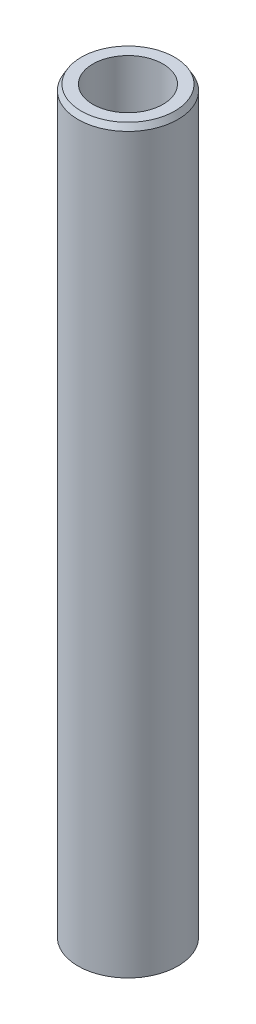
ISO-10303-21;
HEADER;
FILE_DESCRIPTION(('STEP AP214'),'2;1');
FILE_NAME('part.step','',(''),(''),'','','');
FILE_SCHEMA(('AUTOMOTIVE_DESIGN { 1 0 10303 214 1 1 1 1 }'));
ENDSEC;
DATA;
#1=APPLICATION_CONTEXT('core data for automotive mechanical design processes');
#2=APPLICATION_PROTOCOL_DEFINITION('international standard','automotive_design',2000,#1);
#3=PRODUCT_CONTEXT('',#1,'mechanical');
#4=PRODUCT('Part','Part','',(#3));
#5=PRODUCT_RELATED_PRODUCT_CATEGORY('part','',(#4));
#6=PRODUCT_DEFINITION_FORMATION('','',#4);
#7=PRODUCT_DEFINITION_CONTEXT('part definition',#1,'design');
#8=PRODUCT_DEFINITION('design','',#6,#7);
#9=PRODUCT_DEFINITION_SHAPE('','',#8);
#10=(LENGTH_UNIT() NAMED_UNIT(*) SI_UNIT(.MILLI.,.METRE.));
#11=(NAMED_UNIT(*) PLANE_ANGLE_UNIT() SI_UNIT($,.RADIAN.));
#12=(NAMED_UNIT(*) SI_UNIT($,.STERADIAN.) SOLID_ANGLE_UNIT());
#13=UNCERTAINTY_MEASURE_WITH_UNIT(LENGTH_MEASURE(1.E-05),#10,'distance_accuracy_value','');
#14=(GEOMETRIC_REPRESENTATION_CONTEXT(3) GLOBAL_UNCERTAINTY_ASSIGNED_CONTEXT((#13)) GLOBAL_UNIT_ASSIGNED_CONTEXT((#10,
#11,#12)) REPRESENTATION_CONTEXT('',''));
#15=CARTESIAN_POINT('',(0.,0.,0.));
#16=DIRECTION('',(0.,0.,1.));
#17=DIRECTION('',(1.,0.,0.));
#18=AXIS2_PLACEMENT_3D('',#15,#16,#17);
#19=CARTESIAN_POINT('',(0.,222.741329278908,0.));
#20=DIRECTION('',(0.,-1.,0.));
#21=DIRECTION('',(0.,0.,-1.));
#22=AXIS2_PLACEMENT_3D('',#19,#20,#21);
#23=CYLINDRICAL_SURFACE('',#22,15.);
#24=CARTESIAN_POINT('',(0.,221.051541674111,0.));
#25=DIRECTION('',(0.,1.,0.));
#26=DIRECTION('',(0.,0.,1.));
#27=AXIS2_PLACEMENT_3D('',#24,#25,#26);
#28=CIRCLE('',#27,15.);
#29=CARTESIAN_POINT('',(0.,221.051541674111,15.));
#30=VERTEX_POINT('',#29);
#31=EDGE_CURVE('E50',#30,#30,#28,.F.);
#32=ORIENTED_EDGE('',*,*,#31,.T.);
#33=EDGE_LOOP('',(#32));
#34=FACE_BOUND('',#33,.T.);
#35=CARTESIAN_POINT('',(0.,0.975599328502386,0.));
#36=DIRECTION('',(0.,1.,0.));
#37=DIRECTION('',(0.,0.,1.));
#38=AXIS2_PLACEMENT_3D('',#35,#36,#37);
#39=CIRCLE('',#38,15.);
#40=CARTESIAN_POINT('',(0.,0.975599328502386,15.));
#41=VERTEX_POINT('',#40);
#42=EDGE_CURVE('E51',#41,#41,#39,.T.);
#43=ORIENTED_EDGE('',*,*,#42,.T.);
#44=EDGE_LOOP('',(#43));
#45=FACE_BOUND('',#44,.T.);
#46=ADVANCED_FACE('F39',(#34,#45),#23,.T.);
#47=CARTESIAN_POINT('',(0.,222.741329278908,0.));
#48=DIRECTION('',(0.,1.,0.));
#49=DIRECTION('',(0.,0.,1.));
#50=AXIS2_PLACEMENT_3D('',#47,#48,#49);
#51=PLANE('',#50);
#52=CARTESIAN_POINT('',(0.,222.741329278908,0.));
#53=DIRECTION('',(0.,1.,0.));
#54=DIRECTION('',(0.,0.,1.));
#55=AXIS2_PLACEMENT_3D('',#52,#53,#54);
#56=CIRCLE('',#55,14.0244006714976);
#57=CARTESIAN_POINT('',(0.,222.741329278908,14.0244006714976));
#58=VERTEX_POINT('',#57);
#59=EDGE_CURVE('E54',#58,#58,#56,.T.);
#60=ORIENTED_EDGE('',*,*,#59,.T.);
#61=EDGE_LOOP('',(#60));
#62=FACE_BOUND('',#61,.T.);
#63=CARTESIAN_POINT('',(0.,222.741329278908,0.));
#64=DIRECTION('',(0.,1.,0.));
#65=DIRECTION('',(0.,0.,1.));
#66=AXIS2_PLACEMENT_3D('',#63,#64,#65);
#67=CIRCLE('',#66,10.5196206177702);
#68=CARTESIAN_POINT('',(0.,222.741329278908,10.5196206177702));
#69=VERTEX_POINT('',#68);
#70=EDGE_CURVE('E58',#69,#69,#67,.T.);
#71=ORIENTED_EDGE('',*,*,#70,.F.);
#72=EDGE_LOOP('',(#71));
#73=FACE_BOUND('',#72,.T.);
#74=ADVANCED_FACE('F69',(#62,#73),#51,.T.);
#75=CARTESIAN_POINT('',(0.,0.,0.));
#76=DIRECTION('',(0.,1.,0.));
#77=DIRECTION('',(0.,0.,1.));
#78=AXIS2_PLACEMENT_3D('',#75,#76,#77);
#79=PLANE('',#78);
#80=CARTESIAN_POINT('',(0.,0.,0.));
#81=DIRECTION('',(0.,1.,0.));
#82=DIRECTION('',(0.,0.,1.));
#83=AXIS2_PLACEMENT_3D('',#80,#81,#82);
#84=CIRCLE('',#83,13.3102123952038);
#85=CARTESIAN_POINT('',(0.,0.,13.3102123952038));
#86=VERTEX_POINT('',#85);
#87=EDGE_CURVE('E10',#86,#86,#84,.F.);
#88=ORIENTED_EDGE('',*,*,#87,.T.);
#89=EDGE_LOOP('',(#88));
#90=FACE_BOUND('',#89,.T.);
#91=CARTESIAN_POINT('',(0.,0.,0.));
#92=DIRECTION('',(0.,1.,0.));
#93=DIRECTION('',(0.,0.,1.));
#94=AXIS2_PLACEMENT_3D('',#91,#92,#93);
#95=CIRCLE('',#94,10.5196206177702);
#96=CARTESIAN_POINT('',(0.,0.,10.5196206177702));
#97=VERTEX_POINT('',#96);
#98=EDGE_CURVE('E63',#97,#97,#95,.T.);
#99=ORIENTED_EDGE('',*,*,#98,.T.);
#100=EDGE_LOOP('',(#99));
#101=FACE_BOUND('',#100,.T.);
#102=ADVANCED_FACE('F75',(#90,#101),#79,.F.);
#103=CARTESIAN_POINT('',(0.,222.741329278908,0.));
#104=DIRECTION('',(0.,-1.,0.));
#105=DIRECTION('',(0.,0.,-1.));
#106=AXIS2_PLACEMENT_3D('',#103,#104,#105);
#107=CYLINDRICAL_SURFACE('',#106,10.5196206177702);
#108=ORIENTED_EDGE('',*,*,#70,.T.);
#109=EDGE_LOOP('',(#108));
#110=FACE_BOUND('',#109,.T.);
#111=ORIENTED_EDGE('',*,*,#98,.F.);
#112=EDGE_LOOP('',(#111));
#113=FACE_BOUND('',#112,.T.);
#114=ADVANCED_FACE('F70',(#110,#113),#107,.F.);
#115=CARTESIAN_POINT('',(0.,222.741329278908,0.));
#116=DIRECTION('',(0.,-1.,0.));
#117=DIRECTION('',(0.,0.,-1.));
#118=AXIS2_PLACEMENT_3D('',#115,#116,#117);
#119=CONICAL_SURFACE('',#118,14.0244006714976,0.523598775598297);
#120=ORIENTED_EDGE('',*,*,#31,.F.);
#121=EDGE_LOOP('',(#120));
#122=FACE_BOUND('',#121,.T.);
#123=ORIENTED_EDGE('',*,*,#59,.F.);
#124=EDGE_LOOP('',(#123));
#125=FACE_BOUND('',#124,.T.);
#126=ADVANCED_FACE('F81',(#122,#125),#119,.T.);
#127=CARTESIAN_POINT('',(0.,0.975599328502386,0.));
#128=DIRECTION('',(0.,1.,0.));
#129=DIRECTION('',(0.,0.,1.));
#130=AXIS2_PLACEMENT_3D('',#127,#128,#129);
#131=CONICAL_SURFACE('',#130,15.,1.0471975511966);
#132=ORIENTED_EDGE('',*,*,#87,.F.);
#133=EDGE_LOOP('',(#132));
#134=FACE_BOUND('',#133,.T.);
#135=ORIENTED_EDGE('',*,*,#42,.F.);
#136=EDGE_LOOP('',(#135));
#137=FACE_BOUND('',#136,.T.);
#138=ADVANCED_FACE('F45',(#134,#137),#131,.T.);
#139=CLOSED_SHELL('',(#46,#74,#102,#114,#126,#138));
#140=MANIFOLD_SOLID_BREP('B2',#139);
#141=ADVANCED_BREP_SHAPE_REPRESENTATION('',(#18,#140),#14);
#142=SHAPE_DEFINITION_REPRESENTATION(#9,#141);
ENDSEC;
END-ISO-10303-21;
